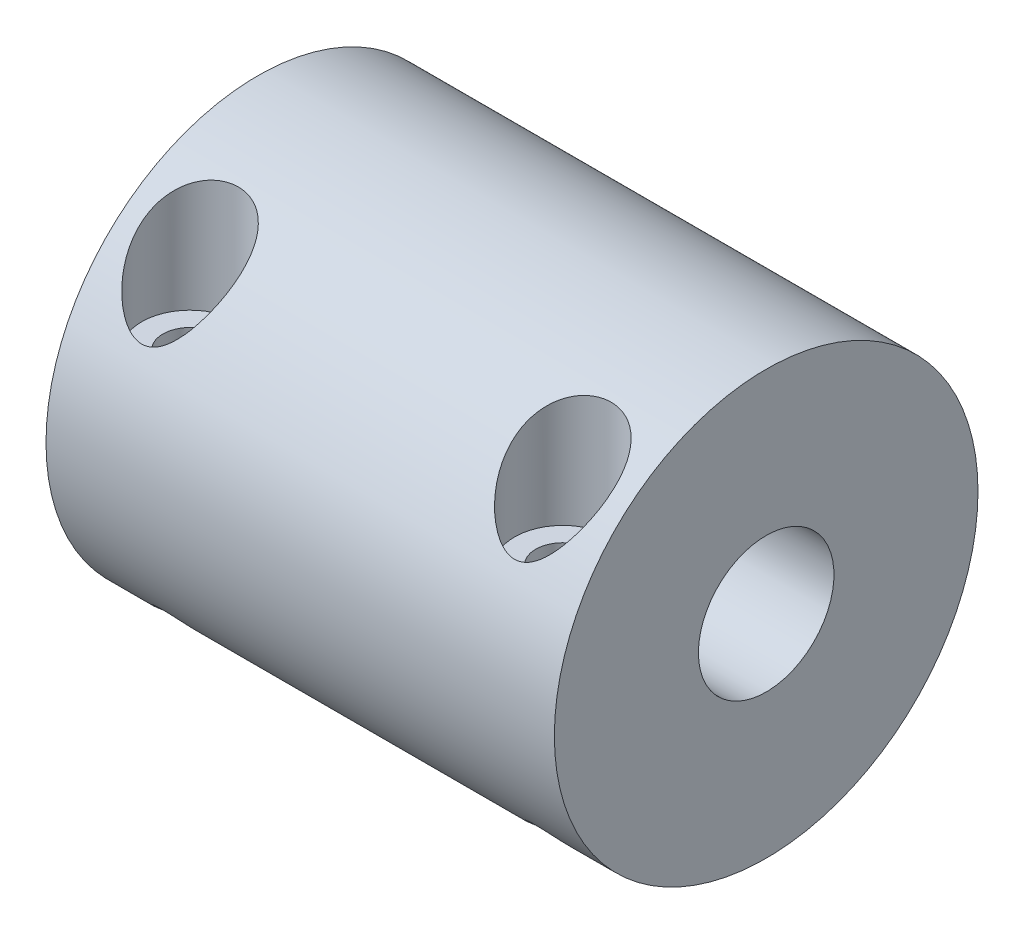
ISO-10303-21;
HEADER;
FILE_DESCRIPTION(('STEP AP214'),'2;1');
FILE_NAME('part.step','',(''),(''),'','','');
FILE_SCHEMA(('AUTOMOTIVE_DESIGN { 1 0 10303 214 1 1 1 1 }'));
ENDSEC;
DATA;
#1=APPLICATION_CONTEXT('core data for automotive mechanical design processes');
#2=APPLICATION_PROTOCOL_DEFINITION('international standard','automotive_design',2000,#1);
#3=PRODUCT_CONTEXT('',#1,'mechanical');
#4=PRODUCT('Part','Part','',(#3));
#5=PRODUCT_RELATED_PRODUCT_CATEGORY('part','',(#4));
#6=PRODUCT_DEFINITION_FORMATION('','',#4);
#7=PRODUCT_DEFINITION_CONTEXT('part definition',#1,'design');
#8=PRODUCT_DEFINITION('design','',#6,#7);
#9=PRODUCT_DEFINITION_SHAPE('','',#8);
#10=(LENGTH_UNIT() NAMED_UNIT(*) SI_UNIT(.MILLI.,.METRE.));
#11=(NAMED_UNIT(*) PLANE_ANGLE_UNIT() SI_UNIT($,.RADIAN.));
#12=(NAMED_UNIT(*) SI_UNIT($,.STERADIAN.) SOLID_ANGLE_UNIT());
#13=UNCERTAINTY_MEASURE_WITH_UNIT(LENGTH_MEASURE(1.E-05),#10,'distance_accuracy_value','');
#14=(GEOMETRIC_REPRESENTATION_CONTEXT(3) GLOBAL_UNCERTAINTY_ASSIGNED_CONTEXT((#13)) GLOBAL_UNIT_ASSIGNED_CONTEXT((#10,
#11,#12)) REPRESENTATION_CONTEXT('',''));
#15=CARTESIAN_POINT('',(0.,0.,0.));
#16=DIRECTION('',(0.,0.,1.));
#17=DIRECTION('',(1.,0.,0.));
#18=AXIS2_PLACEMENT_3D('',#15,#16,#17);
#19=CARTESIAN_POINT('',(26.0000000000001,-12.5,8.));
#20=DIRECTION('',(0.,1.,0.));
#21=DIRECTION('',(0.,0.,1.));
#22=AXIS2_PLACEMENT_3D('',#19,#20,#21);
#23=CYLINDRICAL_SURFACE('',#22,1.6);
#24=CARTESIAN_POINT('',(26.0000000000001,-8.00562302385017,9.6));
#25=CARTESIAN_POINT('',(25.9313707105729,-8.00563259985874,9.59999297105585));
#26=CARTESIAN_POINT('',(25.8626256168826,-8.01099186855372,9.59553061186923));
#27=CARTESIAN_POINT('',(25.7277158300239,-8.0317755392395,9.57813919376363));
#28=CARTESIAN_POINT('',(25.6615588519862,-8.04722791586184,9.56518660248093));
#29=CARTESIAN_POINT('',(25.5344642598436,-8.08630699680547,9.53217058420714));
#30=CARTESIAN_POINT('',(25.4734795109968,-8.10984699712408,9.51218252794316));
#31=CARTESIAN_POINT('',(25.3568051722534,-8.16327814269629,9.46636847645784));
#32=CARTESIAN_POINT('',(25.3011166738942,-8.19317059307773,9.44054128150008));
#33=CARTESIAN_POINT('',(25.1661477919726,-8.27537999440327,9.36869480777459));
#34=CARTESIAN_POINT('',(25.0906545688773,-8.33101094771993,9.31936455144027));
#35=CARTESIAN_POINT('',(24.9521162614139,-8.44927305270708,9.21228591966828));
#36=CARTESIAN_POINT('',(24.8891060483897,-8.51192306962264,9.15451472437066));
#37=CARTESIAN_POINT('',(24.7521926554043,-8.66697523084919,9.00826716837453));
#38=CARTESIAN_POINT('',(24.6838341413481,-8.76134625693878,8.91668225307308));
#39=CARTESIAN_POINT('',(24.5687316144559,-8.95330409409146,8.7239289344755));
#40=CARTESIAN_POINT('',(24.5220046061915,-9.05089337069487,8.62275306672333));
#41=CARTESIAN_POINT('',(24.4496521403614,-9.24782533838565,8.4112393936669));
#42=CARTESIAN_POINT('',(24.4243999178812,-9.34716956475932,8.30077482213007));
#43=CARTESIAN_POINT('',(24.3977054095938,-9.54313597551262,8.07470552784328));
#44=CARTESIAN_POINT('',(24.396241780203,-9.63976052231449,7.95910550612479));
#45=CARTESIAN_POINT('',(24.417390163506,-9.81210530438244,7.74520933168562));
#46=CARTESIAN_POINT('',(24.4360830759356,-9.88865041519606,7.6471933328791));
#47=CARTESIAN_POINT('',(24.4931385035091,-10.0360921882815,7.45262892923733));
#48=CARTESIAN_POINT('',(24.5314764693895,-10.1069957729815,7.35607884721199));
#49=CARTESIAN_POINT('',(24.6201793357562,-10.2288356558177,7.18539232445865));
#50=CARTESIAN_POINT('',(24.667079896289,-10.2810561433764,7.11037743955839));
#51=CARTESIAN_POINT('',(24.7752010484337,-10.3790292115309,6.96658505715279));
#52=CARTESIAN_POINT('',(24.8364189022782,-10.4247830260103,6.8978063706401));
#53=CARTESIAN_POINT('',(24.9733151517665,-10.5087358586897,6.76922650825426));
#54=CARTESIAN_POINT('',(25.0491067825652,-10.54687060643,6.70950265365948));
#55=CARTESIAN_POINT('',(25.2132283813131,-10.6136295219257,6.6033946369109));
#56=CARTESIAN_POINT('',(25.301546266103,-10.6422627672121,6.55699774819044));
#57=CARTESIAN_POINT('',(25.4743321728204,-10.6854384712247,6.48636061195437));
#58=CARTESIAN_POINT('',(25.5575366540596,-10.7014126051831,6.45989740122169));
#59=CARTESIAN_POINT('',(25.7282714255928,-10.724906351552,6.42081903886129));
#60=CARTESIAN_POINT('',(25.8157984579644,-10.7324322328994,6.40819361921112));
#61=CARTESIAN_POINT('',(25.9829290542224,-10.7384336132835,6.39812989935307));
#62=CARTESIAN_POINT('',(26.0624201997861,-10.7377614308972,6.3992613171263));
#63=CARTESIAN_POINT('',(26.2199807291437,-10.7294279398682,6.41322402132648));
#64=CARTESIAN_POINT('',(26.298050437571,-10.721768248011,6.42605260123771));
#65=CARTESIAN_POINT('',(26.4490131189699,-10.6999146620797,6.46237250833092));
#66=CARTESIAN_POINT('',(26.5219781637466,-10.6858537366735,6.48564672224483));
#67=CARTESIAN_POINT('',(26.6626212051718,-10.6516364255991,6.5416904418327));
#68=CARTESIAN_POINT('',(26.730298473876,-10.631479202535,6.57446125194638));
#69=CARTESIAN_POINT('',(26.8623298038252,-10.5843949741172,6.65001178506341));
#70=CARTESIAN_POINT('',(26.9263307590135,-10.5571716664845,6.69322163405471));
#71=CARTESIAN_POINT('',(27.0459335908342,-10.4972432514844,6.78682333861682));
#72=CARTESIAN_POINT('',(27.1015324643239,-10.4645361928383,6.83721774970569));
#73=CARTESIAN_POINT('',(27.2095825264351,-10.3903840892759,6.94945513482987));
#74=CARTESIAN_POINT('',(27.2609639909623,-10.3483689401609,7.01194832229662));
#75=CARTESIAN_POINT('',(27.3524849345407,-10.2594186528165,7.14146435927739));
#76=CARTESIAN_POINT('',(27.3926184838062,-10.2124809373111,7.20848957500638));
#77=CARTESIAN_POINT('',(27.4676056960252,-10.1065123279851,7.35649235441958));
#78=CARTESIAN_POINT('',(27.5004967629378,-10.0467637153409,7.4379478320959));
#79=CARTESIAN_POINT('',(27.5521345872577,-9.92311165436835,7.60213453971552));
#80=CARTESIAN_POINT('',(27.5708735960305,-9.85920595068707,7.68486644327841));
#81=CARTESIAN_POINT('',(27.5975007011186,-9.71550421626555,7.86605437447346));
#82=CARTESIAN_POINT('',(27.6025365590123,-9.63505149810951,7.96440897063876));
#83=CARTESIAN_POINT('',(27.5951116765433,-9.47148647952201,8.15825230484077));
#84=CARTESIAN_POINT('',(27.5826331008122,-9.38837155235756,8.25373802024681));
#85=CARTESIAN_POINT('',(27.5374942456613,-9.20605712550241,8.45696874833637));
#86=CARTESIAN_POINT('',(27.5016036883547,-9.10665698317495,8.56382404983344));
#87=CARTESIAN_POINT('',(27.4076546303945,-8.90933209131129,8.76892350120356));
#88=CARTESIAN_POINT('',(27.3495961252877,-8.81140734207148,8.86716764934675));
#89=CARTESIAN_POINT('',(27.2274933833851,-8.6439943538393,9.03003721474966));
#90=CARTESIAN_POINT('',(27.1682494557153,-8.57333256978088,9.09706441580375));
#91=CARTESIAN_POINT('',(27.0358526043413,-8.43787781835048,9.22283518460059));
#92=CARTESIAN_POINT('',(26.9627263355911,-8.37307394977234,9.28159425722595));
#93=CARTESIAN_POINT('',(26.8262933731139,-8.27183439574781,9.37175927775277));
#94=CARTESIAN_POINT('',(26.7668310853167,-8.23278664998653,9.4060328380363));
#95=CARTESIAN_POINT('',(26.6406115722749,-8.16163880548309,9.46783306249284));
#96=CARTESIAN_POINT('',(26.5738635157952,-8.12953012259991,9.4953680684142));
#97=CARTESIAN_POINT('',(26.4482592600873,-8.08057480578164,9.53703978746559));
#98=CARTESIAN_POINT('',(26.3906332412002,-8.06194438426379,9.55277047388164));
#99=CARTESIAN_POINT('',(26.2721998140207,-8.03215911508848,9.57782890273355));
#100=CARTESIAN_POINT('',(26.2114011690514,-8.02098474045783,9.58717337188854));
#101=CARTESIAN_POINT('',(26.125053467803,-8.01125451801778,9.59530151499089));
#102=CARTESIAN_POINT('',(26.100128763306,-8.00914804134274,9.59705954399219));
#103=CARTESIAN_POINT('',(26.0501412157331,-8.00633036934367,9.59941021715822));
#104=CARTESIAN_POINT('',(26.0250783395329,-8.00561952460959,9.60000256849881));
#105=CARTESIAN_POINT('',(26.0000000000001,-8.00562302385017,9.6));
#106=B_SPLINE_CURVE_WITH_KNOTS('',3,(#24,#25,#26,#27,#28,#29,#30,#31,#32,#33,#34,#35,#36,#37,
#38,#39,#40,#41,#42,#43,#44,#45,#46,#47,#48,#49,#50,#51,#52,#53,#54,#55,#56,#57,#58,#59,#60,#61,
#62,#63,#64,#65,#66,#67,#68,#69,#70,#71,#72,#73,#74,#75,#76,#77,#78,#79,#80,#81,#82,#83,#84,#85,
#86,#87,#88,#89,#90,#91,#92,#93,#94,#95,#96,#97,#98,#99,#100,#101,#102,#103,#104,#105),
.UNSPECIFIED.,.T.,.F.,(4,2,2,2,2,2,2,2,2,2,2,2,2,2,2,2,2,2,2,2,2,2,2,2,2,2,2,2,2,2,2,2,2,2,2,2,
2,2,2,2,4),(0.,0.205760982191094,0.412094697122283,0.616282063808042,0.820511421961977,
1.1366150085624,1.45358955210834,1.89590116431221,2.33855989061922,2.78876341233102,
3.23856298046024,3.61440362768622,3.98977575029034,4.29675026194212,4.6036661215384,
4.91307076310092,5.22217894930962,5.48696849257781,5.75156142140486,5.98890229197332,
6.22618826000814,6.4587555428131,6.69135478590219,6.93598847476254,7.18070939689102,
7.45314748127405,7.72572892320687,8.04326833221659,8.36098147684331,8.7410638257436,
9.12153350256299,9.57053324480969,10.0195330772539,10.3605137360858,10.7008461941402,
10.9370179776144,11.1728959049231,11.359902833848,11.5464180592946,11.6215878308829,
11.6967764830904),.UNSPECIFIED.);
#107=CARTESIAN_POINT('',(26.0000000000001,-8.00562302385017,9.6));
#108=VERTEX_POINT('',#107);
#109=EDGE_CURVE('E56',#108,#108,#106,.T.);
#110=ORIENTED_EDGE('',*,*,#109,.T.);
#111=EDGE_LOOP('',(#110));
#112=FACE_BOUND('',#111,.T.);
#113=CARTESIAN_POINT('',(26.0000000000001,4.49939580580495,8.));
#114=DIRECTION('',(0.,1.,0.));
#115=DIRECTION('',(0.,0.,1.));
#116=AXIS2_PLACEMENT_3D('',#113,#114,#115);
#117=CIRCLE('',#116,1.6);
#118=CARTESIAN_POINT('',(26.0000000000001,4.49939580580496,9.6));
#119=VERTEX_POINT('',#118);
#120=EDGE_CURVE('E141',#119,#119,#117,.F.);
#121=ORIENTED_EDGE('',*,*,#120,.F.);
#122=EDGE_LOOP('',(#121));
#123=FACE_BOUND('',#122,.T.);
#124=ADVANCED_FACE('F34',(#112,#123),#23,.F.);
#125=CARTESIAN_POINT('',(4.,-12.5,8.));
#126=DIRECTION('',(0.,1.,0.));
#127=DIRECTION('',(0.,0.,1.));
#128=AXIS2_PLACEMENT_3D('',#125,#126,#127);
#129=CYLINDRICAL_SURFACE('',#128,1.6);
#130=CARTESIAN_POINT('',(4.,-8.00562302385018,9.6));
#131=CARTESIAN_POINT('',(3.93137071057281,-8.00563259985875,9.59999297105585));
#132=CARTESIAN_POINT('',(3.86262561688247,-8.01099186855372,9.59553061186922));
#133=CARTESIAN_POINT('',(3.72771583002382,-8.0317755392395,9.57813919376362));
#134=CARTESIAN_POINT('',(3.66155885198603,-8.04722791586185,9.56518660248092));
#135=CARTESIAN_POINT('',(3.53446425984348,-8.08630699680548,9.53217058420713));
#136=CARTESIAN_POINT('',(3.47347951099665,-8.10984699712409,9.51218252794316));
#137=CARTESIAN_POINT('',(3.35680517225328,-8.16327814269629,9.46636847645784));
#138=CARTESIAN_POINT('',(3.3011166738941,-8.19317059307774,9.44054128150007));
#139=CARTESIAN_POINT('',(3.16614779197245,-8.27537999440328,9.36869480777458));
#140=CARTESIAN_POINT('',(3.09065456887716,-8.33101094771994,9.31936455144026));
#141=CARTESIAN_POINT('',(2.95211626141377,-8.44927305270709,9.21228591966827));
#142=CARTESIAN_POINT('',(2.88910604838962,-8.51192306962264,9.15451472437065));
#143=CARTESIAN_POINT('',(2.7521926554042,-8.66697523084919,9.00826716837453));
#144=CARTESIAN_POINT('',(2.68383414134797,-8.76134625693879,8.91668225307307));
#145=CARTESIAN_POINT('',(2.56873161445577,-8.95330409409147,8.72392893447549));
#146=CARTESIAN_POINT('',(2.52200460619134,-9.05089337069488,8.62275306672332));
#147=CARTESIAN_POINT('',(2.44965214036124,-9.24782533838566,8.41123939366689));
#148=CARTESIAN_POINT('',(2.42439991788111,-9.34716956475933,8.30077482213006));
#149=CARTESIAN_POINT('',(2.39770540959364,-9.54313597551263,8.07470552784327));
#150=CARTESIAN_POINT('',(2.39624178020287,-9.6397605223145,7.95910550612479));
#151=CARTESIAN_POINT('',(2.41739016350592,-9.81210530438244,7.74520933168561));
#152=CARTESIAN_POINT('',(2.4360830759355,-9.88865041519606,7.64719333287909));
#153=CARTESIAN_POINT('',(2.49313850350895,-10.0360921882815,7.45262892923733));
#154=CARTESIAN_POINT('',(2.53147646938941,-10.1069957729815,7.35607884721199));
#155=CARTESIAN_POINT('',(2.62017933575612,-10.2288356558177,7.18539232445865));
#156=CARTESIAN_POINT('',(2.66707989628884,-10.2810561433764,7.11037743955839));
#157=CARTESIAN_POINT('',(2.7752010484336,-10.3790292115309,6.96658505715279));
#158=CARTESIAN_POINT('',(2.83641890227813,-10.4247830260103,6.8978063706401));
#159=CARTESIAN_POINT('',(2.97331515176643,-10.5087358586897,6.76922650825426));
#160=CARTESIAN_POINT('',(3.04910678256505,-10.54687060643,6.70950265365948));
#161=CARTESIAN_POINT('',(3.21322838131303,-10.6136295219257,6.6033946369109));
#162=CARTESIAN_POINT('',(3.30154626610287,-10.6422627672121,6.55699774819044));
#163=CARTESIAN_POINT('',(3.47433217282027,-10.6854384712247,6.48636061195437));
#164=CARTESIAN_POINT('',(3.55753665405952,-10.7014126051831,6.45989740122169));
#165=CARTESIAN_POINT('',(3.72827142559263,-10.724906351552,6.4208190388613));
#166=CARTESIAN_POINT('',(3.81579845796424,-10.7324322328994,6.40819361921112));
#167=CARTESIAN_POINT('',(3.98292905422231,-10.7384336132835,6.39812989935308));
#168=CARTESIAN_POINT('',(4.06242019978597,-10.7377614308972,6.3992613171263));
#169=CARTESIAN_POINT('',(4.21998072914355,-10.7294279398682,6.41322402132649));
#170=CARTESIAN_POINT('',(4.29805043757083,-10.721768248011,6.42605260123771));
#171=CARTESIAN_POINT('',(4.4490131189698,-10.6999146620797,6.46237250833092));
#172=CARTESIAN_POINT('',(4.52197816374646,-10.6858537366735,6.48564672224483));
#173=CARTESIAN_POINT('',(4.66262120517165,-10.6516364255991,6.54169044183271));
#174=CARTESIAN_POINT('',(4.73029847387586,-10.631479202535,6.57446125194639));
#175=CARTESIAN_POINT('',(4.86232980382505,-10.5843949741172,6.65001178506342));
#176=CARTESIAN_POINT('',(4.92633075901334,-10.5571716664845,6.69322163405471));
#177=CARTESIAN_POINT('',(5.0459335908341,-10.4972432514844,6.78682333861682));
#178=CARTESIAN_POINT('',(5.10153246432376,-10.4645361928382,6.8372177497057));
#179=CARTESIAN_POINT('',(5.209582526435,-10.3903840892759,6.94945513482988));
#180=CARTESIAN_POINT('',(5.2609639909622,-10.3483689401609,7.01194832229662));
#181=CARTESIAN_POINT('',(5.35248493454057,-10.2594186528165,7.14146435927739));
#182=CARTESIAN_POINT('',(5.39261848380603,-10.2124809373111,7.20848957500639));
#183=CARTESIAN_POINT('',(5.46760569602503,-10.1065123279851,7.35649235441959));
#184=CARTESIAN_POINT('',(5.50049676293767,-10.0467637153409,7.43794783209591));
#185=CARTESIAN_POINT('',(5.55213458725761,-9.92311165436834,7.60213453971553));
#186=CARTESIAN_POINT('',(5.57087359603036,-9.85920595068707,7.68486644327841));
#187=CARTESIAN_POINT('',(5.59750070111844,-9.71550421626554,7.86605437447347));
#188=CARTESIAN_POINT('',(5.60253655901214,-9.63505149810951,7.96440897063876));
#189=CARTESIAN_POINT('',(5.59511167654313,-9.47148647952201,8.15825230484078));
#190=CARTESIAN_POINT('',(5.58263310081204,-9.38837155235755,8.25373802024682));
#191=CARTESIAN_POINT('',(5.53749424566121,-9.2060571255024,8.45696874833637));
#192=CARTESIAN_POINT('',(5.50160368835455,-9.10665698317494,8.56382404983345));
#193=CARTESIAN_POINT('',(5.40765463039435,-8.90933209131129,8.76892350120356));
#194=CARTESIAN_POINT('',(5.34959612528758,-8.81140734207148,8.86716764934675));
#195=CARTESIAN_POINT('',(5.227493383385,-8.6439943538393,9.03003721474966));
#196=CARTESIAN_POINT('',(5.16824945571515,-8.57333256978088,9.09706441580375));
#197=CARTESIAN_POINT('',(5.03585260434114,-8.43787781835048,9.22283518460059));
#198=CARTESIAN_POINT('',(4.96272633559099,-8.37307394977234,9.28159425722595));
#199=CARTESIAN_POINT('',(4.82629337311382,-8.27183439574781,9.37175927775276));
#200=CARTESIAN_POINT('',(4.76683108531657,-8.23278664998654,9.40603283803629));
#201=CARTESIAN_POINT('',(4.6406115722748,-8.1616388054831,9.46783306249284));
#202=CARTESIAN_POINT('',(4.57386351579506,-8.12953012259992,9.4953680684142));
#203=CARTESIAN_POINT('',(4.44825926008716,-8.08057480578165,9.53703978746559));
#204=CARTESIAN_POINT('',(4.39063324120012,-8.06194438426379,9.55277047388163));
#205=CARTESIAN_POINT('',(4.27219981402056,-8.03215911508849,9.57782890273354));
#206=CARTESIAN_POINT('',(4.21140116905124,-8.02098474045784,9.58717337188853));
#207=CARTESIAN_POINT('',(4.12505346780288,-8.01125451801779,9.59530151499088));
#208=CARTESIAN_POINT('',(4.10012876330587,-8.00914804134274,9.59705954399218));
#209=CARTESIAN_POINT('',(4.05014121573295,-8.00633036934367,9.59941021715822));
#210=CARTESIAN_POINT('',(4.02507833953281,-8.0056195246096,9.60000256849881));
#211=CARTESIAN_POINT('',(4.,-8.00562302385018,9.6));
#212=B_SPLINE_CURVE_WITH_KNOTS('',3,(#130,#131,#132,#133,#134,#135,#136,#137,#138,#139,#140,
#141,#142,#143,#144,#145,#146,#147,#148,#149,#150,#151,#152,#153,#154,#155,#156,#157,#158,#159,
#160,#161,#162,#163,#164,#165,#166,#167,#168,#169,#170,#171,#172,#173,#174,#175,#176,#177,#178,
#179,#180,#181,#182,#183,#184,#185,#186,#187,#188,#189,#190,#191,#192,#193,#194,#195,#196,#197,
#198,#199,#200,#201,#202,#203,#204,#205,#206,#207,#208,#209,#210,#211),.UNSPECIFIED.,.T.,.F.,(4,
2,2,2,2,2,2,2,2,2,2,2,2,2,2,2,2,2,2,2,2,2,2,2,2,2,2,2,2,2,2,2,2,2,2,2,2,2,2,2,4),(0.,
0.205760982191093,0.412094697122283,0.616282063808044,0.820511421961978,1.1366150085624,
1.45358955210834,1.89590116431222,2.33855989061922,2.78876341233102,3.23856298046024,
3.61440362768622,3.98977575029034,4.29675026194212,4.60366612153839,4.91307076310092,
5.2221789493096,5.4869684925778,5.75156142140484,5.9889022919733,6.22618826000812,
6.45875554281308,6.69135478590217,6.93598847476252,7.18070939689099,7.45314748127403,
7.72572892320685,8.04326833221657,8.36098147684329,8.74106382574358,9.12153350256296,
9.57053324480967,10.0195330772538,10.3605137360857,10.7008461941402,10.9370179776144,
11.1728959049231,11.3599028338479,11.5464180592945,11.6215878308828,11.6967764830904),.UNSPECIFIED.);
#213=CARTESIAN_POINT('',(4.,-8.00562302385018,9.6));
#214=VERTEX_POINT('',#213);
#215=EDGE_CURVE('E63',#214,#214,#212,.T.);
#216=ORIENTED_EDGE('',*,*,#215,.T.);
#217=EDGE_LOOP('',(#216));
#218=FACE_BOUND('',#217,.T.);
#219=CARTESIAN_POINT('',(4.,4.49939580580495,8.));
#220=DIRECTION('',(0.,1.,0.));
#221=DIRECTION('',(0.,0.,1.));
#222=AXIS2_PLACEMENT_3D('',#219,#220,#221);
#223=CIRCLE('',#222,1.6);
#224=CARTESIAN_POINT('',(4.,4.49939580580496,9.6));
#225=VERTEX_POINT('',#224);
#226=EDGE_CURVE('E139',#225,#225,#223,.F.);
#227=ORIENTED_EDGE('',*,*,#226,.F.);
#228=EDGE_LOOP('',(#227));
#229=FACE_BOUND('',#228,.T.);
#230=ADVANCED_FACE('F75',(#218,#229),#129,.F.);
#231=CARTESIAN_POINT('',(-118.942669600284,0.,0.));
#232=DIRECTION('',(-1.,0.,0.));
#233=DIRECTION('',(0.,0.,1.));
#234=AXIS2_PLACEMENT_3D('',#231,#232,#233);
#235=CYLINDRICAL_SURFACE('',#234,3.);
#236=CARTESIAN_POINT('',(15.,0.,0.));
#237=DIRECTION('',(-1.,0.,0.));
#238=DIRECTION('',(0.,0.,1.));
#239=AXIS2_PLACEMENT_3D('',#236,#237,#238);
#240=CIRCLE('',#239,3.);
#241=CARTESIAN_POINT('',(15.,0.,3.));
#242=VERTEX_POINT('',#241);
#243=EDGE_CURVE('E10',#242,#242,#240,.T.);
#244=ORIENTED_EDGE('',*,*,#243,.F.);
#245=EDGE_LOOP('',(#244));
#246=FACE_BOUND('',#245,.T.);
#247=CARTESIAN_POINT('',(0.,0.,0.));
#248=DIRECTION('',(-1.,0.,0.));
#249=DIRECTION('',(0.,0.,1.));
#250=AXIS2_PLACEMENT_3D('',#247,#248,#249);
#251=CIRCLE('',#250,3.);
#252=CARTESIAN_POINT('',(0.,0.,3.));
#253=VERTEX_POINT('',#252);
#254=EDGE_CURVE('E98',#253,#253,#251,.T.);
#255=ORIENTED_EDGE('',*,*,#254,.T.);
#256=EDGE_LOOP('',(#255));
#257=FACE_BOUND('',#256,.T.);
#258=ADVANCED_FACE('F36',(#246,#257),#235,.F.);
#259=CARTESIAN_POINT('',(15.,0.,0.));
#260=DIRECTION('',(-1.,0.,0.));
#261=DIRECTION('',(0.,0.,1.));
#262=AXIS2_PLACEMENT_3D('',#259,#260,#261);
#263=PLANE('',#262);
#264=CARTESIAN_POINT('',(15.,0.,0.));
#265=DIRECTION('',(-1.,0.,0.));
#266=DIRECTION('',(0.,0.,1.));
#267=AXIS2_PLACEMENT_3D('',#264,#265,#266);
#268=CIRCLE('',#267,4.);
#269=CARTESIAN_POINT('',(15.,0.,4.));
#270=VERTEX_POINT('',#269);
#271=EDGE_CURVE('E47',#270,#270,#268,.T.);
#272=ORIENTED_EDGE('',*,*,#271,.F.);
#273=EDGE_LOOP('',(#272));
#274=FACE_BOUND('',#273,.T.);
#275=ORIENTED_EDGE('',*,*,#243,.T.);
#276=EDGE_LOOP('',(#275));
#277=FACE_BOUND('',#276,.T.);
#278=ADVANCED_FACE('F115',(#274,#277),#263,.F.);
#279=CARTESIAN_POINT('',(-118.942669600284,0.,0.));
#280=DIRECTION('',(-1.,0.,0.));
#281=DIRECTION('',(0.,0.,1.));
#282=AXIS2_PLACEMENT_3D('',#279,#280,#281);
#283=CYLINDRICAL_SURFACE('',#282,4.);
#284=ORIENTED_EDGE('',*,*,#271,.T.);
#285=EDGE_LOOP('',(#284));
#286=FACE_BOUND('',#285,.T.);
#287=CARTESIAN_POINT('',(30.,0.,0.));
#288=DIRECTION('',(-1.,0.,0.));
#289=DIRECTION('',(0.,0.,1.));
#290=AXIS2_PLACEMENT_3D('',#287,#288,#289);
#291=CIRCLE('',#290,4.);
#292=CARTESIAN_POINT('',(30.,0.,4.));
#293=VERTEX_POINT('',#292);
#294=EDGE_CURVE('E52',#293,#293,#291,.T.);
#295=ORIENTED_EDGE('',*,*,#294,.F.);
#296=EDGE_LOOP('',(#295));
#297=FACE_BOUND('',#296,.T.);
#298=ADVANCED_FACE('F113',(#286,#297),#283,.F.);
#299=CARTESIAN_POINT('',(30.,0.,0.));
#300=DIRECTION('',(-1.,0.,0.));
#301=DIRECTION('',(0.,0.,1.));
#302=AXIS2_PLACEMENT_3D('',#299,#300,#301);
#303=PLANE('',#302);
#304=CARTESIAN_POINT('',(30.,0.,0.));
#305=DIRECTION('',(-1.,0.,0.));
#306=DIRECTION('',(0.,0.,1.));
#307=AXIS2_PLACEMENT_3D('',#304,#305,#306);
#308=CIRCLE('',#307,12.5);
#309=CARTESIAN_POINT('',(30.,0.,12.5));
#310=VERTEX_POINT('',#309);
#311=EDGE_CURVE('E101',#310,#310,#308,.T.);
#312=ORIENTED_EDGE('',*,*,#311,.F.);
#313=EDGE_LOOP('',(#312));
#314=FACE_BOUND('',#313,.T.);
#315=ORIENTED_EDGE('',*,*,#294,.T.);
#316=EDGE_LOOP('',(#315));
#317=FACE_BOUND('',#316,.T.);
#318=ADVANCED_FACE('F90',(#314,#317),#303,.F.);
#319=CARTESIAN_POINT('',(-118.942669600284,0.,0.));
#320=DIRECTION('',(-1.,0.,0.));
#321=DIRECTION('',(0.,0.,1.));
#322=AXIS2_PLACEMENT_3D('',#319,#320,#321);
#323=CYLINDRICAL_SURFACE('',#322,12.5);
#324=CARTESIAN_POINT('',(4.,6.20705244057136,10.8499999999999));
#325=CARTESIAN_POINT('',(4.08718150068978,6.20706617887909,10.8499933758664));
#326=CARTESIAN_POINT('',(4.174448521432,6.21414208489554,10.8459535812084));
#327=CARTESIAN_POINT('',(4.34620378612653,6.24152308835145,10.8302177828832));
#328=CARTESIAN_POINT('',(4.43068618813216,6.26185434275241,10.8185066410248));
#329=CARTESIAN_POINT('',(4.6181147270078,6.3207592422599,10.7842223197344));
#330=CARTESIAN_POINT('',(4.71953993825303,6.36286257864976,10.7595160054967));
#331=CARTESIAN_POINT('',(4.91342358145748,6.45984794061202,10.7015672594988));
#332=CARTESIAN_POINT('',(5.00586070179052,6.5147593365059,10.6683051901339));
#333=CARTESIAN_POINT('',(5.16709967262394,6.62316135658196,10.6012780540195));
#334=CARTESIAN_POINT('',(5.23725524234493,6.67532254037172,10.5685488322457));
#335=CARTESIAN_POINT('',(5.37207880233202,6.78398201406358,10.4991307010719));
#336=CARTESIAN_POINT('',(5.43674305995828,6.84048320511635,10.4624391362086));
#337=CARTESIAN_POINT('',(5.56111637888629,6.95669174054608,10.3855335121061));
#338=CARTESIAN_POINT('',(5.62081615250486,7.01640476476906,10.3453131275428));
#339=CARTESIAN_POINT('',(5.73554389536695,7.13809168485673,10.2617300923168));
#340=CARTESIAN_POINT('',(5.79057038601336,7.20006628746904,10.2183664551329));
#341=CARTESIAN_POINT('',(5.92840347914185,7.36380225440582,10.1014738996756));
#342=CARTESIAN_POINT('',(6.00775396149217,7.46683953973888,10.0256374160399));
#343=CARTESIAN_POINT('',(6.15599417804477,7.6751562431437,9.86707390644913));
#344=CARTESIAN_POINT('',(6.22487818451846,7.78043685318939,9.78434314570405));
#345=CARTESIAN_POINT('',(6.35252712632938,7.99198305765071,9.61232590265572));
#346=CARTESIAN_POINT('',(6.41128191889673,8.09824952835632,9.52303297551563));
#347=CARTESIAN_POINT('',(6.51850045694202,8.31058927742235,9.33830337812639));
#348=CARTESIAN_POINT('',(6.56696628251693,8.41666259052569,9.24286795478562));
#349=CARTESIAN_POINT('',(6.65408244666957,8.62984306479405,9.04419449437522));
#350=CARTESIAN_POINT('',(6.69251834390813,8.73692881510011,8.94083900588876));
#351=CARTESIAN_POINT('',(6.75756934786141,8.9491117709059,8.72845550157438));
#352=CARTESIAN_POINT('',(6.78418229784088,9.05420861024467,8.61942645482827));
#353=CARTESIAN_POINT('',(6.82454273085031,9.26126629778422,8.39654777782006));
#354=CARTESIAN_POINT('',(6.83831882432572,9.36323362765537,8.28270946163302));
#355=CARTESIAN_POINT('',(6.85190800237423,9.56325724762678,8.05093505293943));
#356=CARTESIAN_POINT('',(6.8517284573504,9.66131557481314,7.93300115633182));
#357=CARTESIAN_POINT('',(6.83329205127823,9.8864274449487,7.65188227792456));
#358=CARTESIAN_POINT('',(6.80867074445682,10.011484953471,7.48743100077569));
#359=CARTESIAN_POINT('',(6.72798082285474,10.2497634604735,7.15776660361283));
#360=CARTESIAN_POINT('',(6.6719525803309,10.3629994337971,6.99255473117485));
#361=CARTESIAN_POINT('',(6.53690641797438,10.5587032162541,6.69259164090832));
#362=CARTESIAN_POINT('',(6.46271439439259,10.6432281118065,6.55704584162621));
#363=CARTESIAN_POINT('',(6.33271942022829,10.76088313127,6.36076047095608));
#364=CARTESIAN_POINT('',(6.28624432726543,10.7985946142478,6.29647636946954));
#365=CARTESIAN_POINT('',(6.18711880035296,10.8708098246682,6.17095765994191));
#366=CARTESIAN_POINT('',(6.13447100809071,10.905314913078,6.10972176325007));
#367=CARTESIAN_POINT('',(6.02280580825078,10.9711758096108,5.99065649200784));
#368=CARTESIAN_POINT('',(5.96375027929789,11.0025103559987,5.93285106934581));
#369=CARTESIAN_POINT('',(5.83986558156166,11.0616426071645,5.82185666928396));
#370=CARTESIAN_POINT('',(5.77503914786002,11.0894419724056,5.76866552833011));
#371=CARTESIAN_POINT('',(5.63999435359923,11.1414265365243,5.66761382023436));
#372=CARTESIAN_POINT('',(5.56977621268545,11.1656118825103,5.61975303614078));
#373=CARTESIAN_POINT('',(5.42451673132385,11.2102999556774,5.53007070289502));
#374=CARTESIAN_POINT('',(5.34947594677287,11.2308031062679,5.48824845948977));
#375=CARTESIAN_POINT('',(5.13450777300008,11.282749141993,5.38102590683083));
#376=CARTESIAN_POINT('',(4.98986045966699,11.3101555846971,5.32286809302345));
#377=CARTESIAN_POINT('',(4.69149006141631,11.3530550263524,5.23075142018311));
#378=CARTESIAN_POINT('',(4.53777055878513,11.3685526942122,5.19678307790172));
#379=CARTESIAN_POINT('',(4.23525626650587,11.3871620397944,5.1558711619426));
#380=CARTESIAN_POINT('',(4.08670029044541,11.3909459426738,5.14746140139381));
#381=CARTESIAN_POINT('',(3.79021044112934,11.3880491411794,5.15386778572674));
#382=CARTESIAN_POINT('',(3.64227647030324,11.3813701445282,5.16868014036555));
#383=CARTESIAN_POINT('',(3.35344114986092,11.3576967301714,5.2204891408475));
#384=CARTESIAN_POINT('',(3.2124690170366,11.3408529587443,5.25716171368704));
#385=CARTESIAN_POINT('',(2.93916368759658,11.296949249888,5.35084993864422));
#386=CARTESIAN_POINT('',(2.80683038018724,11.2698894435105,5.40786532980287));
#387=CARTESIAN_POINT('',(2.55223906419792,11.205111393907,5.54084864801082));
#388=CARTESIAN_POINT('',(2.43016440155332,11.1672376545768,5.61709102517197));
#389=CARTESIAN_POINT('',(2.20112470186003,11.0812420594576,5.78488908575801));
#390=CARTESIAN_POINT('',(2.09416201494513,11.0331186126005,5.87644714617151));
#391=CARTESIAN_POINT('',(1.89207084833235,10.9243470324046,6.07636557755907));
#392=CARTESIAN_POINT('',(1.79784306577822,10.8631790238643,6.18535085255173));
#393=CARTESIAN_POINT('',(1.62911079991098,10.7308917549586,6.41211346448802));
#394=CARTESIAN_POINT('',(1.55461138924477,10.659769942398,6.52989305270421));
#395=CARTESIAN_POINT('',(1.41844177147522,10.500676013868,6.78309856415451));
#396=CARTESIAN_POINT('',(1.35895853659901,10.4117175188514,6.91907417345687));
#397=CARTESIAN_POINT('',(1.26285134732708,10.2245465795726,7.19278623216704));
#398=CARTESIAN_POINT('',(1.22624799945599,10.1263258847556,7.33052415519983));
#399=CARTESIAN_POINT('',(1.18143643291582,9.9508701621995,7.56606705461374));
#400=CARTESIAN_POINT('',(1.16815563568515,9.87542394350152,7.66429361627192));
#401=CARTESIAN_POINT('',(1.15181434830679,9.72120031486861,7.85898946735636));
#402=CARTESIAN_POINT('',(1.14875752335312,9.64242172055607,7.95545811426431));
#403=CARTESIAN_POINT('',(1.15383712215423,9.40188369881695,8.24113722741377));
#404=CARTESIAN_POINT('',(1.1762164055914,9.2358909585632,8.42666261655516));
#405=CARTESIAN_POINT('',(1.25430996993918,8.89469870150226,8.7861737917274));
#406=CARTESIAN_POINT('',(1.31049077352967,8.71940223904787,8.95995949850072));
#407=CARTESIAN_POINT('',(1.45306917849511,8.36506880516321,9.29163903216235));
#408=CARTESIAN_POINT('',(1.53954909609735,8.18602290600104,9.44948804213259));
#409=CARTESIAN_POINT('',(1.70211231377736,7.89838273683084,9.68947389052521));
#410=CARTESIAN_POINT('',(1.76926260884167,7.78934461681527,9.77726676451783));
#411=CARTESIAN_POINT('',(1.91463474832673,7.57296212848492,9.94580427957095));
#412=CARTESIAN_POINT('',(1.99286535124916,7.4656191754576,10.0265432624148));
#413=CARTESIAN_POINT('',(2.16062120797561,7.25507497382458,10.1799201615183));
#414=CARTESIAN_POINT('',(2.2500908524274,7.15185642359182,10.2525948547475));
#415=CARTESIAN_POINT('',(2.44180444080646,6.9518837984087,10.3892197947607));
#416=CARTESIAN_POINT('',(2.54402443968024,6.85511811447899,10.4531859371639));
#417=CARTESIAN_POINT('',(2.73317342587178,6.69757364225386,10.5545604520298));
#418=CARTESIAN_POINT('',(2.81660054591092,6.63420648858782,10.5944397072498));
#419=CARTESIAN_POINT('',(2.99211560166795,6.51603482706312,10.6675252390469));
#420=CARTESIAN_POINT('',(3.08419730082227,6.46122422792743,10.7007362674943));
#421=CARTESIAN_POINT('',(3.26317376595179,6.37135627559492,10.7544482240277));
#422=CARTESIAN_POINT('',(3.34884219578774,6.33457976025832,10.7760997479924));
#423=CARTESIAN_POINT('',(3.52599428700076,6.2735511430017,10.8117448639659));
#424=CARTESIAN_POINT('',(3.61746077325242,6.2492638291542,10.825759992681));
#425=CARTESIAN_POINT('',(3.75826882104959,6.22427192352131,10.8401350119103));
#426=CARTESIAN_POINT('',(3.80630251090082,6.21784312815039,10.8438209559829));
#427=CARTESIAN_POINT('',(3.90288190526757,6.20922926598304,10.8487554639481));
#428=CARTESIAN_POINT('',(3.95142767969833,6.20704478640759,10.8500036905711));
#429=CARTESIAN_POINT('',(4.,6.20705244057136,10.8499999999999));
#430=B_SPLINE_CURVE_WITH_KNOTS('',3,(#324,#325,#326,#327,#328,#329,#330,#331,#332,#333,#334,
#335,#336,#337,#338,#339,#340,#341,#342,#343,#344,#345,#346,#347,#348,#349,#350,#351,#352,#353,
#354,#355,#356,#357,#358,#359,#360,#361,#362,#363,#364,#365,#366,#367,#368,#369,#370,#371,#372,
#373,#374,#375,#376,#377,#378,#379,#380,#381,#382,#383,#384,#385,#386,#387,#388,#389,#390,#391,
#392,#393,#394,#395,#396,#397,#398,#399,#400,#401,#402,#403,#404,#405,#406,#407,#408,#409,#410,
#411,#412,#413,#414,#415,#416,#417,#418,#419,#420,#421,#422,#423,#424,#425,#426,#427,#428,#429),
.UNSPECIFIED.,.T.,.F.,(4,2,2,2,2,2,2,2,2,2,2,2,2,2,2,2,2,2,2,2,2,2,2,2,2,2,2,2,2,2,2,2,2,2,2,2,
2,2,2,2,2,2,2,2,2,2,2,2,2,2,2,2,4),(0.,0.26133986536784,0.523197003575942,0.858981404363552,
1.19554350086448,1.4752025252386,1.75505014707163,2.03541005821162,2.31585834553187,
2.76685584601931,3.21809927063749,3.66979195072309,4.12139322598449,4.58197829789642,
5.0426473550078,5.50228721199368,5.96168432064594,6.5833900361057,7.20429840240202,
7.73025559080321,7.99347573007803,8.25658362923599,8.52135290754208,8.78599736158807,
9.05063104035986,9.31523426984002,9.78742122627381,10.2594229643127,10.7037821677683,
11.1480688518187,11.5859273974567,12.0237803264189,12.4682770359405,12.9128427953073,
13.3804502251234,13.8481777717589,14.3653209010473,14.8829291211825,15.2561519997966,
15.6295086608275,16.376066346355,17.1331721464835,17.8923509985459,18.3576674166423,
18.8233537214261,19.2868204857198,19.7494296105335,20.0850871243888,20.4205045884408,
20.7066306790675,20.991945583721,21.1375283926595,21.283131342228),.UNSPECIFIED.);
#431=CARTESIAN_POINT('',(4.,6.20705244057136,10.8499999999999));
#432=VERTEX_POINT('',#431);
#433=EDGE_CURVE('E38',#432,#432,#430,.T.);
#434=ORIENTED_EDGE('',*,*,#433,.F.);
#435=EDGE_LOOP('',(#434));
#436=FACE_BOUND('',#435,.T.);
#437=CARTESIAN_POINT('',(26.0000000000001,6.20705244057136,10.8499999999999));
#438=CARTESIAN_POINT('',(26.0871815006899,6.20706617887909,10.8499933758664));
#439=CARTESIAN_POINT('',(26.1744485214321,6.21414208489554,10.8459535812084));
#440=CARTESIAN_POINT('',(26.3462037861267,6.24152308835144,10.8302177828832));
#441=CARTESIAN_POINT('',(26.4306861881323,6.26185434275241,10.8185066410248));
#442=CARTESIAN_POINT('',(26.6181147270079,6.3207592422599,10.7842223197344));
#443=CARTESIAN_POINT('',(26.7195399382532,6.36286257864976,10.7595160054967));
#444=CARTESIAN_POINT('',(26.9134235814576,6.45984794061202,10.7015672594987));
#445=CARTESIAN_POINT('',(27.0058607017906,6.5147593365059,10.6683051901339));
#446=CARTESIAN_POINT('',(27.1670996726241,6.62316135658196,10.6012780540195));
#447=CARTESIAN_POINT('',(27.2372552423451,6.67532254037172,10.5685488322457));
#448=CARTESIAN_POINT('',(27.3720788023321,6.78398201406358,10.4991307010719));
#449=CARTESIAN_POINT('',(27.4367430599584,6.84048320511635,10.4624391362086));
#450=CARTESIAN_POINT('',(27.5611163788864,6.95669174054608,10.3855335121061));
#451=CARTESIAN_POINT('',(27.620816152505,7.01640476476906,10.3453131275428));
#452=CARTESIAN_POINT('',(27.7355438953671,7.13809168485673,10.2617300923168));
#453=CARTESIAN_POINT('',(27.7905703860135,7.20006628746904,10.2183664551329));
#454=CARTESIAN_POINT('',(27.928403479142,7.36380225440582,10.1014738996756));
#455=CARTESIAN_POINT('',(28.0077539614923,7.46683953973888,10.0256374160399));
#456=CARTESIAN_POINT('',(28.1559941780449,7.6751562431437,9.86707390644913));
#457=CARTESIAN_POINT('',(28.2248781845186,7.78043685318939,9.78434314570405));
#458=CARTESIAN_POINT('',(28.3525271263295,7.9919830576507,9.61232590265572));
#459=CARTESIAN_POINT('',(28.4112819188969,8.09824952835632,9.52303297551564));
#460=CARTESIAN_POINT('',(28.5185004569421,8.31058927742234,9.3383033781264));
#461=CARTESIAN_POINT('',(28.5669662825171,8.41666259052569,9.24286795478562));
#462=CARTESIAN_POINT('',(28.6540824466697,8.62984306479404,9.04419449437522));
#463=CARTESIAN_POINT('',(28.6925183439083,8.73692881510011,8.94083900588876));
#464=CARTESIAN_POINT('',(28.7575693478615,8.9491117709059,8.72845550157439));
#465=CARTESIAN_POINT('',(28.784182297841,9.05420861024466,8.61942645482828));
#466=CARTESIAN_POINT('',(28.8245427308504,9.26126629778422,8.39654777782006));
#467=CARTESIAN_POINT('',(28.8383188243258,9.36323362765537,8.28270946163303));
#468=CARTESIAN_POINT('',(28.8519080023743,9.56325724762677,8.05093505293944));
#469=CARTESIAN_POINT('',(28.8517284573505,9.66131557481314,7.93300115633182));
#470=CARTESIAN_POINT('',(28.8332920512783,9.8864274449487,7.65188227792457));
#471=CARTESIAN_POINT('',(28.8086707444569,10.011484953471,7.4874310007757));
#472=CARTESIAN_POINT('',(28.7279808228549,10.2497634604735,7.15776660361284));
#473=CARTESIAN_POINT('',(28.671952580331,10.3629994337971,6.99255473117486));
#474=CARTESIAN_POINT('',(28.5369064179745,10.5587032162541,6.69259164090833));
#475=CARTESIAN_POINT('',(28.4627143943927,10.6432281118065,6.55704584162622));
#476=CARTESIAN_POINT('',(28.3327194202284,10.76088313127,6.36076047095609));
#477=CARTESIAN_POINT('',(28.2862443272656,10.7985946142477,6.29647636946954));
#478=CARTESIAN_POINT('',(28.1871188003531,10.8708098246682,6.17095765994192));
#479=CARTESIAN_POINT('',(28.1344710080908,10.905314913078,6.10972176325008));
#480=CARTESIAN_POINT('',(28.0228058082509,10.9711758096108,5.99065649200785));
#481=CARTESIAN_POINT('',(27.963750279298,11.0025103559987,5.93285106934581));
#482=CARTESIAN_POINT('',(27.8398655815618,11.0616426071645,5.82185666928397));
#483=CARTESIAN_POINT('',(27.7750391478601,11.0894419724056,5.76866552833012));
#484=CARTESIAN_POINT('',(27.6399943535994,11.1414265365243,5.66761382023436));
#485=CARTESIAN_POINT('',(27.5697762126856,11.1656118825103,5.61975303614078));
#486=CARTESIAN_POINT('',(27.424516731324,11.2102999556774,5.53007070289502));
#487=CARTESIAN_POINT('',(27.349475946773,11.2308031062679,5.48824845948977));
#488=CARTESIAN_POINT('',(27.1345077730002,11.282749141993,5.38102590683083));
#489=CARTESIAN_POINT('',(26.9898604596671,11.3101555846971,5.32286809302345));
#490=CARTESIAN_POINT('',(26.6914900614164,11.3530550263524,5.23075142018311));
#491=CARTESIAN_POINT('',(26.5377705587853,11.3685526942122,5.19678307790172));
#492=CARTESIAN_POINT('',(26.235256266506,11.3871620397944,5.1558711619426));
#493=CARTESIAN_POINT('',(26.0867002904455,11.3909459426738,5.14746140139382));
#494=CARTESIAN_POINT('',(25.7902104411295,11.3880491411794,5.15386778572674));
#495=CARTESIAN_POINT('',(25.6422764703034,11.3813701445282,5.16868014036555));
#496=CARTESIAN_POINT('',(25.353441149861,11.3576967301714,5.2204891408475));
#497=CARTESIAN_POINT('',(25.2124690170367,11.3408529587443,5.25716171368704));
#498=CARTESIAN_POINT('',(24.9391636875967,11.296949249888,5.35084993864422));
#499=CARTESIAN_POINT('',(24.8068303801874,11.2698894435105,5.40786532980286));
#500=CARTESIAN_POINT('',(24.552239064198,11.205111393907,5.54084864801082));
#501=CARTESIAN_POINT('',(24.4301644015534,11.1672376545768,5.61709102517197));
#502=CARTESIAN_POINT('',(24.2011247018602,11.0812420594577,5.784889085758));
#503=CARTESIAN_POINT('',(24.0941620149453,11.0331186126005,5.8764471461715));
#504=CARTESIAN_POINT('',(23.8920708483325,10.9243470324046,6.07636557755907));
#505=CARTESIAN_POINT('',(23.7978430657783,10.8631790238643,6.18535085255173));
#506=CARTESIAN_POINT('',(23.6291107999111,10.7308917549586,6.41211346448802));
#507=CARTESIAN_POINT('',(23.5546113892449,10.659769942398,6.52989305270421));
#508=CARTESIAN_POINT('',(23.4184417714753,10.500676013868,6.7830985641545));
#509=CARTESIAN_POINT('',(23.3589585365991,10.4117175188514,6.91907417345687));
#510=CARTESIAN_POINT('',(23.2628513473272,10.2245465795726,7.19278623216704));
#511=CARTESIAN_POINT('',(23.2262479994561,10.1263258847556,7.33052415519982));
#512=CARTESIAN_POINT('',(23.1814364329159,9.95087016219951,7.56606705461374));
#513=CARTESIAN_POINT('',(23.1681556356853,9.87542394350153,7.66429361627192));
#514=CARTESIAN_POINT('',(23.1518143483069,9.72120031486861,7.85898946735636));
#515=CARTESIAN_POINT('',(23.1487575233532,9.64242172055607,7.95545811426431));
#516=CARTESIAN_POINT('',(23.1538371221544,9.40188369881695,8.24113722741377));
#517=CARTESIAN_POINT('',(23.1762164055915,9.2358909585632,8.42666261655516));
#518=CARTESIAN_POINT('',(23.2543099699393,8.89469870150226,8.7861737917274));
#519=CARTESIAN_POINT('',(23.3104907735298,8.71940223904788,8.95995949850071));
#520=CARTESIAN_POINT('',(23.4530691784952,8.36506880516322,9.29163903216234));
#521=CARTESIAN_POINT('',(23.5395490960975,8.18602290600104,9.44948804213258));
#522=CARTESIAN_POINT('',(23.7021123137775,7.89838273683085,9.6894738905252));
#523=CARTESIAN_POINT('',(23.7692626088418,7.78934461681528,9.77726676451782));
#524=CARTESIAN_POINT('',(23.9146347483269,7.57296212848493,9.94580427957095));
#525=CARTESIAN_POINT('',(23.9928653512493,7.46561917545761,10.0265432624148));
#526=CARTESIAN_POINT('',(24.1606212079757,7.2550749738246,10.1799201615183));
#527=CARTESIAN_POINT('',(24.2500908524275,7.15185642359183,10.2525948547475));
#528=CARTESIAN_POINT('',(24.4418044408066,6.95188379840871,10.3892197947607));
#529=CARTESIAN_POINT('',(24.5440244396804,6.855118114479,10.4531859371639));
#530=CARTESIAN_POINT('',(24.7331734258719,6.69757364225387,10.5545604520298));
#531=CARTESIAN_POINT('',(24.816600545911,6.63420648858782,10.5944397072498));
#532=CARTESIAN_POINT('',(24.9921156016681,6.51603482706312,10.6675252390469));
#533=CARTESIAN_POINT('',(25.0841973008224,6.46122422792743,10.7007362674943));
#534=CARTESIAN_POINT('',(25.2631737659519,6.37135627559492,10.7544482240277));
#535=CARTESIAN_POINT('',(25.3488421957879,6.33457976025833,10.7760997479924));
#536=CARTESIAN_POINT('',(25.5259942870009,6.27355114300171,10.8117448639659));
#537=CARTESIAN_POINT('',(25.6174607732525,6.2492638291542,10.825759992681));
#538=CARTESIAN_POINT('',(25.7582688210497,6.22427192352131,10.8401350119103));
#539=CARTESIAN_POINT('',(25.8063025109009,6.21784312815039,10.8438209559829));
#540=CARTESIAN_POINT('',(25.9028819052677,6.20922926598304,10.8487554639481));
#541=CARTESIAN_POINT('',(25.9514276796985,6.20704478640759,10.8500036905711));
#542=CARTESIAN_POINT('',(26.0000000000001,6.20705244057136,10.8499999999999));
#543=B_SPLINE_CURVE_WITH_KNOTS('',3,(#437,#438,#439,#440,#441,#442,#443,#444,#445,#446,#447,
#448,#449,#450,#451,#452,#453,#454,#455,#456,#457,#458,#459,#460,#461,#462,#463,#464,#465,#466,
#467,#468,#469,#470,#471,#472,#473,#474,#475,#476,#477,#478,#479,#480,#481,#482,#483,#484,#485,
#486,#487,#488,#489,#490,#491,#492,#493,#494,#495,#496,#497,#498,#499,#500,#501,#502,#503,#504,
#505,#506,#507,#508,#509,#510,#511,#512,#513,#514,#515,#516,#517,#518,#519,#520,#521,#522,#523,
#524,#525,#526,#527,#528,#529,#530,#531,#532,#533,#534,#535,#536,#537,#538,#539,#540,#541,#542),
.UNSPECIFIED.,.T.,.F.,(4,2,2,2,2,2,2,2,2,2,2,2,2,2,2,2,2,2,2,2,2,2,2,2,2,2,2,2,2,2,2,2,2,2,2,2,
2,2,2,2,2,2,2,2,2,2,2,2,2,2,2,2,4),(0.,0.261339865367841,0.523197003575946,0.858981404363549,
1.19554350086448,1.4752025252386,1.75505014707163,2.03541005821162,2.31585834553186,
2.7668558460193,3.21809927063748,3.66979195072309,4.12139322598448,4.58197829789641,
5.04264735500779,5.50228721199367,5.96168432064593,6.58339003610569,7.20429840240201,
7.7302555908032,7.99347573007802,8.25658362923598,8.52135290754208,8.78599736158806,
9.05063104035985,9.31523426984002,9.78742122627381,10.2594229643127,10.7037821677683,
11.1480688518186,11.5859273974567,12.0237803264189,12.4682770359404,12.9128427953073,
13.3804502251234,13.8481777717589,14.3653209010472,14.8829291211825,15.2561519997966,
15.6295086608275,16.376066346355,17.1331721464835,17.8923509985458,18.3576674166423,
18.823353721426,19.2868204857198,19.7494296105334,20.0850871243888,20.4205045884408,
20.7066306790675,20.991945583721,21.1375283926595,21.283131342228),.UNSPECIFIED.);
#544=CARTESIAN_POINT('',(26.0000000000001,6.20705244057136,10.8499999999999));
#545=VERTEX_POINT('',#544);
#546=EDGE_CURVE('E144',#545,#545,#543,.T.);
#547=ORIENTED_EDGE('',*,*,#546,.F.);
#548=EDGE_LOOP('',(#547));
#549=FACE_BOUND('',#548,.T.);
#550=ORIENTED_EDGE('',*,*,#215,.F.);
#551=EDGE_LOOP('',(#550));
#552=FACE_BOUND('',#551,.T.);
#553=ORIENTED_EDGE('',*,*,#109,.F.);
#554=EDGE_LOOP('',(#553));
#555=FACE_BOUND('',#554,.T.);
#556=ORIENTED_EDGE('',*,*,#311,.T.);
#557=EDGE_LOOP('',(#556));
#558=FACE_BOUND('',#557,.T.);
#559=CARTESIAN_POINT('',(0.,0.,0.));
#560=DIRECTION('',(-1.,0.,0.));
#561=DIRECTION('',(0.,0.,1.));
#562=AXIS2_PLACEMENT_3D('',#559,#560,#561);
#563=CIRCLE('',#562,12.5);
#564=CARTESIAN_POINT('',(0.,0.,12.5));
#565=VERTEX_POINT('',#564);
#566=EDGE_CURVE('E95',#565,#565,#563,.T.);
#567=ORIENTED_EDGE('',*,*,#566,.F.);
#568=EDGE_LOOP('',(#567));
#569=FACE_BOUND('',#568,.T.);
#570=ADVANCED_FACE('F69',(#436,#549,#552,#555,#558,#569),#323,.T.);
#571=CARTESIAN_POINT('',(0.,0.,0.));
#572=DIRECTION('',(-1.,0.,0.));
#573=DIRECTION('',(0.,0.,1.));
#574=AXIS2_PLACEMENT_3D('',#571,#572,#573);
#575=PLANE('',#574);
#576=ORIENTED_EDGE('',*,*,#566,.T.);
#577=EDGE_LOOP('',(#576));
#578=FACE_BOUND('',#577,.T.);
#579=ORIENTED_EDGE('',*,*,#254,.F.);
#580=EDGE_LOOP('',(#579));
#581=FACE_BOUND('',#580,.T.);
#582=ADVANCED_FACE('F79',(#578,#581),#575,.T.);
#583=CARTESIAN_POINT('',(4.,4.49939580580495,7.99999999999988));
#584=DIRECTION('',(0.,1.,0.));
#585=DIRECTION('',(0.,0.,1.));
#586=AXIS2_PLACEMENT_3D('',#583,#584,#585);
#587=PLANE('',#586);
#588=CARTESIAN_POINT('',(4.,4.49939580580495,7.99999999999988));
#589=DIRECTION('',(0.,1.,0.));
#590=DIRECTION('',(0.,0.,1.));
#591=AXIS2_PLACEMENT_3D('',#588,#589,#590);
#592=CIRCLE('',#591,2.85);
#593=CARTESIAN_POINT('',(4.,4.49939580580497,10.8499999999999));
#594=VERTEX_POINT('',#593);
#595=EDGE_CURVE('E142',#594,#594,#592,.T.);
#596=ORIENTED_EDGE('',*,*,#595,.T.);
#597=EDGE_LOOP('',(#596));
#598=FACE_BOUND('',#597,.T.);
#599=ORIENTED_EDGE('',*,*,#226,.T.);
#600=EDGE_LOOP('',(#599));
#601=FACE_BOUND('',#600,.T.);
#602=ADVANCED_FACE('F81',(#598,#601),#587,.T.);
#603=CARTESIAN_POINT('',(4.,4.49939580580495,7.99999999999988));
#604=DIRECTION('',(0.,1.,0.));
#605=DIRECTION('',(0.,0.,1.));
#606=AXIS2_PLACEMENT_3D('',#603,#604,#605);
#607=CYLINDRICAL_SURFACE('',#606,2.85);
#608=ORIENTED_EDGE('',*,*,#433,.T.);
#609=EDGE_LOOP('',(#608));
#610=FACE_BOUND('',#609,.T.);
#611=ORIENTED_EDGE('',*,*,#595,.F.);
#612=EDGE_LOOP('',(#611));
#613=FACE_BOUND('',#612,.T.);
#614=ADVANCED_FACE('F87',(#610,#613),#607,.F.);
#615=CARTESIAN_POINT('',(26.0000000000001,4.49939580580495,7.99999999999988));
#616=DIRECTION('',(0.,1.,0.));
#617=DIRECTION('',(0.,0.,1.));
#618=AXIS2_PLACEMENT_3D('',#615,#616,#617);
#619=PLANE('',#618);
#620=CARTESIAN_POINT('',(26.0000000000001,4.49939580580495,7.99999999999988));
#621=DIRECTION('',(0.,1.,0.));
#622=DIRECTION('',(0.,0.,1.));
#623=AXIS2_PLACEMENT_3D('',#620,#621,#622);
#624=CIRCLE('',#623,2.85);
#625=CARTESIAN_POINT('',(26.0000000000001,4.49939580580497,10.8499999999999));
#626=VERTEX_POINT('',#625);
#627=EDGE_CURVE('E105',#626,#626,#624,.T.);
#628=ORIENTED_EDGE('',*,*,#627,.T.);
#629=EDGE_LOOP('',(#628));
#630=FACE_BOUND('',#629,.T.);
#631=ORIENTED_EDGE('',*,*,#120,.T.);
#632=EDGE_LOOP('',(#631));
#633=FACE_BOUND('',#632,.T.);
#634=ADVANCED_FACE('F155',(#630,#633),#619,.T.);
#635=CARTESIAN_POINT('',(26.0000000000001,4.49939580580495,7.99999999999988));
#636=DIRECTION('',(0.,1.,0.));
#637=DIRECTION('',(0.,0.,1.));
#638=AXIS2_PLACEMENT_3D('',#635,#636,#637);
#639=CYLINDRICAL_SURFACE('',#638,2.85);
#640=ORIENTED_EDGE('',*,*,#546,.T.);
#641=EDGE_LOOP('',(#640));
#642=FACE_BOUND('',#641,.T.);
#643=ORIENTED_EDGE('',*,*,#627,.F.);
#644=EDGE_LOOP('',(#643));
#645=FACE_BOUND('',#644,.T.);
#646=ADVANCED_FACE('F151',(#642,#645),#639,.F.);
#647=CLOSED_SHELL('',(#124,#230,#258,#278,#298,#318,#570,#582,#602,#614,#634,#646));
#648=MANIFOLD_SOLID_BREP('B2',#647);
#649=ADVANCED_BREP_SHAPE_REPRESENTATION('',(#18,#648),#14);
#650=SHAPE_DEFINITION_REPRESENTATION(#9,#649);
ENDSEC;
END-ISO-10303-21;
